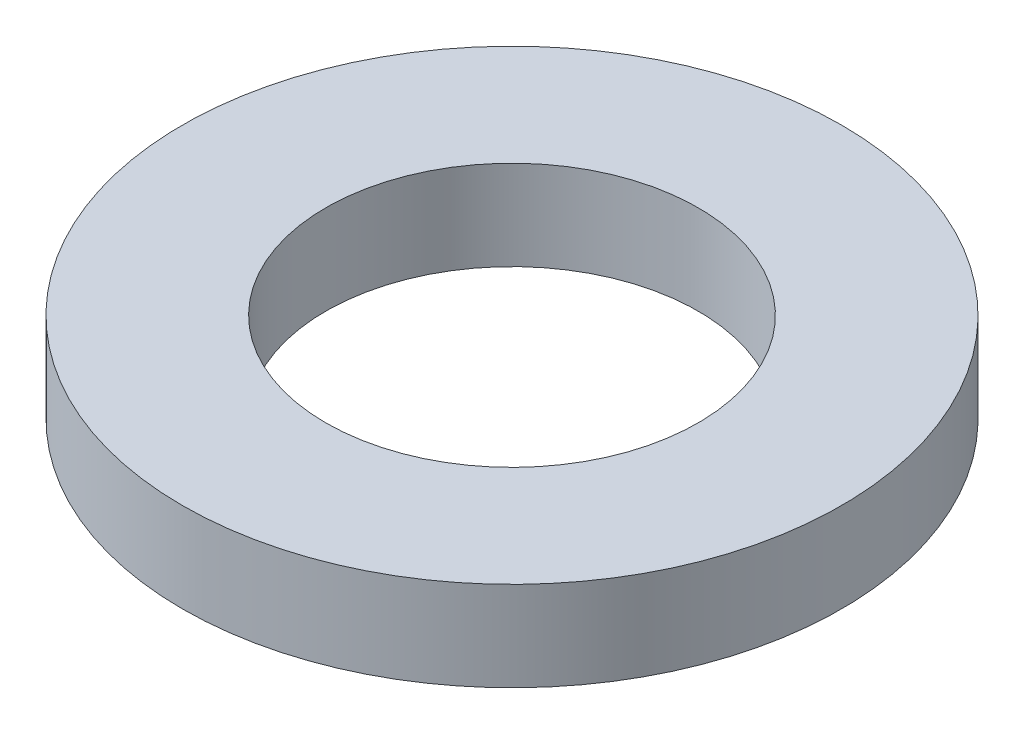
ISO-10303-21;
HEADER;
FILE_DESCRIPTION(('STEP AP214'),'2;1');
FILE_NAME('part.step','',(''),(''),'','','');
FILE_SCHEMA(('AUTOMOTIVE_DESIGN { 1 0 10303 214 1 1 1 1 }'));
ENDSEC;
DATA;
#1=APPLICATION_CONTEXT('core data for automotive mechanical design processes');
#2=APPLICATION_PROTOCOL_DEFINITION('international standard','automotive_design',2000,#1);
#3=PRODUCT_CONTEXT('',#1,'mechanical');
#4=PRODUCT('Part','Part','',(#3));
#5=PRODUCT_RELATED_PRODUCT_CATEGORY('part','',(#4));
#6=PRODUCT_DEFINITION_FORMATION('','',#4);
#7=PRODUCT_DEFINITION_CONTEXT('part definition',#1,'design');
#8=PRODUCT_DEFINITION('design','',#6,#7);
#9=PRODUCT_DEFINITION_SHAPE('','',#8);
#10=(LENGTH_UNIT() NAMED_UNIT(*) SI_UNIT(.MILLI.,.METRE.));
#11=(NAMED_UNIT(*) PLANE_ANGLE_UNIT() SI_UNIT($,.RADIAN.));
#12=(NAMED_UNIT(*) SI_UNIT($,.STERADIAN.) SOLID_ANGLE_UNIT());
#13=UNCERTAINTY_MEASURE_WITH_UNIT(LENGTH_MEASURE(1.E-05),#10,'distance_accuracy_value','');
#14=(GEOMETRIC_REPRESENTATION_CONTEXT(3) GLOBAL_UNCERTAINTY_ASSIGNED_CONTEXT((#13)) GLOBAL_UNIT_ASSIGNED_CONTEXT((#10,
#11,#12)) REPRESENTATION_CONTEXT('',''));
#15=CARTESIAN_POINT('',(0.,0.,0.));
#16=DIRECTION('',(0.,0.,1.));
#17=DIRECTION('',(1.,0.,0.));
#18=AXIS2_PLACEMENT_3D('',#15,#16,#17);
#19=CARTESIAN_POINT('',(0.,1.5875,0.));
#20=DIRECTION('',(0.,1.,0.));
#21=DIRECTION('',(0.,0.,1.));
#22=AXIS2_PLACEMENT_3D('',#19,#20,#21);
#23=PLANE('',#22);
#24=CARTESIAN_POINT('',(0.,1.5875,0.));
#25=DIRECTION('',(0.,1.,0.));
#26=DIRECTION('',(0.,0.,1.));
#27=AXIS2_PLACEMENT_3D('',#24,#25,#26);
#28=CIRCLE('',#27,5.842);
#29=CARTESIAN_POINT('',(0.,1.5875,5.842));
#30=VERTEX_POINT('',#29);
#31=EDGE_CURVE('E10',#30,#30,#28,.T.);
#32=ORIENTED_EDGE('',*,*,#31,.T.);
#33=EDGE_LOOP('',(#32));
#34=FACE_BOUND('',#33,.T.);
#35=CARTESIAN_POINT('',(0.,1.5875,0.));
#36=DIRECTION('',(0.,1.,0.));
#37=DIRECTION('',(0.,0.,1.));
#38=AXIS2_PLACEMENT_3D('',#35,#36,#37);
#39=CIRCLE('',#38,3.302);
#40=CARTESIAN_POINT('',(0.,1.5875,3.302));
#41=VERTEX_POINT('',#40);
#42=EDGE_CURVE('E45',#41,#41,#39,.T.);
#43=ORIENTED_EDGE('',*,*,#42,.F.);
#44=EDGE_LOOP('',(#43));
#45=FACE_BOUND('',#44,.T.);
#46=ADVANCED_FACE('F34',(#34,#45),#23,.T.);
#47=CARTESIAN_POINT('',(0.,0.,0.));
#48=DIRECTION('',(0.,1.,0.));
#49=DIRECTION('',(0.,0.,1.));
#50=AXIS2_PLACEMENT_3D('',#47,#48,#49);
#51=PLANE('',#50);
#52=CARTESIAN_POINT('',(0.,0.,0.));
#53=DIRECTION('',(0.,1.,0.));
#54=DIRECTION('',(0.,0.,1.));
#55=AXIS2_PLACEMENT_3D('',#52,#53,#54);
#56=CIRCLE('',#55,5.842);
#57=CARTESIAN_POINT('',(0.,0.,5.842));
#58=VERTEX_POINT('',#57);
#59=EDGE_CURVE('E38',#58,#58,#56,.T.);
#60=ORIENTED_EDGE('',*,*,#59,.F.);
#61=EDGE_LOOP('',(#60));
#62=FACE_BOUND('',#61,.T.);
#63=CARTESIAN_POINT('',(0.,0.,0.));
#64=DIRECTION('',(0.,1.,0.));
#65=DIRECTION('',(0.,0.,1.));
#66=AXIS2_PLACEMENT_3D('',#63,#64,#65);
#67=CIRCLE('',#66,3.302);
#68=CARTESIAN_POINT('',(0.,0.,3.302));
#69=VERTEX_POINT('',#68);
#70=EDGE_CURVE('E47',#69,#69,#67,.T.);
#71=ORIENTED_EDGE('',*,*,#70,.T.);
#72=EDGE_LOOP('',(#71));
#73=FACE_BOUND('',#72,.T.);
#74=ADVANCED_FACE('F57',(#62,#73),#51,.F.);
#75=CARTESIAN_POINT('',(0.,1.5875,0.));
#76=DIRECTION('',(0.,-1.,0.));
#77=DIRECTION('',(0.,0.,-1.));
#78=AXIS2_PLACEMENT_3D('',#75,#76,#77);
#79=CYLINDRICAL_SURFACE('',#78,5.842);
#80=ORIENTED_EDGE('',*,*,#31,.F.);
#81=EDGE_LOOP('',(#80));
#82=FACE_BOUND('',#81,.T.);
#83=ORIENTED_EDGE('',*,*,#59,.T.);
#84=EDGE_LOOP('',(#83));
#85=FACE_BOUND('',#84,.T.);
#86=ADVANCED_FACE('F36',(#82,#85),#79,.T.);
#87=CARTESIAN_POINT('',(0.,1.5875,0.));
#88=DIRECTION('',(0.,-1.,0.));
#89=DIRECTION('',(0.,0.,-1.));
#90=AXIS2_PLACEMENT_3D('',#87,#88,#89);
#91=CYLINDRICAL_SURFACE('',#90,3.302);
#92=ORIENTED_EDGE('',*,*,#42,.T.);
#93=EDGE_LOOP('',(#92));
#94=FACE_BOUND('',#93,.T.);
#95=ORIENTED_EDGE('',*,*,#70,.F.);
#96=EDGE_LOOP('',(#95));
#97=FACE_BOUND('',#96,.T.);
#98=ADVANCED_FACE('F53',(#94,#97),#91,.F.);
#99=CLOSED_SHELL('',(#46,#74,#86,#98));
#100=MANIFOLD_SOLID_BREP('B2',#99);
#101=ADVANCED_BREP_SHAPE_REPRESENTATION('',(#18,#100),#14);
#102=SHAPE_DEFINITION_REPRESENTATION(#9,#101);
ENDSEC;
END-ISO-10303-21;
